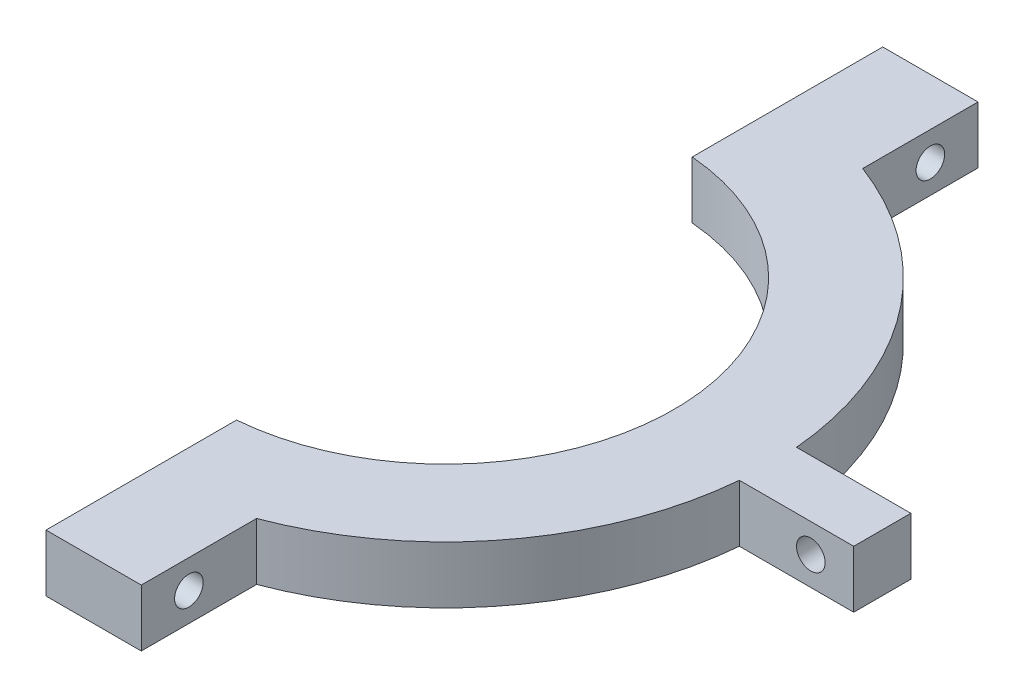
ISO-10303-21;
HEADER;
FILE_DESCRIPTION(('STEP AP214'),'2;1');
FILE_NAME('part.step','',(''),(''),'','','');
FILE_SCHEMA(('AUTOMOTIVE_DESIGN { 1 0 10303 214 1 1 1 1 }'));
ENDSEC;
DATA;
#1=APPLICATION_CONTEXT('core data for automotive mechanical design processes');
#2=APPLICATION_PROTOCOL_DEFINITION('international standard','automotive_design',2000,#1);
#3=PRODUCT_CONTEXT('',#1,'mechanical');
#4=PRODUCT('Part','Part','',(#3));
#5=PRODUCT_RELATED_PRODUCT_CATEGORY('part','',(#4));
#6=PRODUCT_DEFINITION_FORMATION('','',#4);
#7=PRODUCT_DEFINITION_CONTEXT('part definition',#1,'design');
#8=PRODUCT_DEFINITION('design','',#6,#7);
#9=PRODUCT_DEFINITION_SHAPE('','',#8);
#10=(LENGTH_UNIT() NAMED_UNIT(*) SI_UNIT(.MILLI.,.METRE.));
#11=(NAMED_UNIT(*) PLANE_ANGLE_UNIT() SI_UNIT($,.RADIAN.));
#12=(NAMED_UNIT(*) SI_UNIT($,.STERADIAN.) SOLID_ANGLE_UNIT());
#13=UNCERTAINTY_MEASURE_WITH_UNIT(LENGTH_MEASURE(1.E-05),#10,'distance_accuracy_value','');
#14=(GEOMETRIC_REPRESENTATION_CONTEXT(3) GLOBAL_UNCERTAINTY_ASSIGNED_CONTEXT((#13)) GLOBAL_UNIT_ASSIGNED_CONTEXT((#10,
#11,#12)) REPRESENTATION_CONTEXT('',''));
#15=CARTESIAN_POINT('',(0.,0.,0.));
#16=DIRECTION('',(0.,0.,1.));
#17=DIRECTION('',(1.,0.,0.));
#18=AXIS2_PLACEMENT_3D('',#15,#16,#17);
#19=CARTESIAN_POINT('',(12.,6.,43.9165214862028));
#20=DIRECTION('',(-1.,0.,0.));
#21=DIRECTION('',(0.,0.,1.));
#22=AXIS2_PLACEMENT_3D('',#19,#20,#21);
#23=PLANE('',#22);
#24=CARTESIAN_POINT('',(12.,3.,38.9165214862028));
#25=DIRECTION('',(1.,0.,0.));
#26=DIRECTION('',(0.,0.,-1.));
#27=AXIS2_PLACEMENT_3D('',#24,#25,#26);
#28=CIRCLE('',#27,1.5);
#29=CARTESIAN_POINT('',(12.,3.,37.4165214862028));
#30=VERTEX_POINT('',#29);
#31=EDGE_CURVE('E263',#30,#30,#28,.T.);
#32=ORIENTED_EDGE('',*,*,#31,.F.);
#33=EDGE_LOOP('',(#32));
#34=FACE_BOUND('',#33,.T.);
#35=DIRECTION('',(0.,0.,-1.));
#36=VECTOR('',#35,1.);
#37=CARTESIAN_POINT('',(12.,0.,43.9165214862028));
#38=LINE('',#37,#36);
#39=CARTESIAN_POINT('',(12.,0.,43.9165214862028));
#40=VERTEX_POINT('',#39);
#41=CARTESIAN_POINT('',(12.,0.,31.8119474411737));
#42=VERTEX_POINT('',#41);
#43=EDGE_CURVE('E154',#40,#42,#38,.T.);
#44=ORIENTED_EDGE('',*,*,#43,.T.);
#45=DIRECTION('',(0.,-1.,0.));
#46=VECTOR('',#45,1.);
#47=CARTESIAN_POINT('',(12.,6.,31.8119474411737));
#48=LINE('',#47,#46);
#49=CARTESIAN_POINT('',(12.,6.,31.8119474411737));
#50=VERTEX_POINT('',#49);
#51=EDGE_CURVE('E11',#50,#42,#48,.T.);
#52=ORIENTED_EDGE('',*,*,#51,.F.);
#53=DIRECTION('',(0.,0.,-1.));
#54=VECTOR('',#53,1.);
#55=CARTESIAN_POINT('',(12.,6.,43.9165214862028));
#56=LINE('',#55,#54);
#57=CARTESIAN_POINT('',(12.,6.,43.9165214862028));
#58=VERTEX_POINT('',#57);
#59=EDGE_CURVE('E177',#58,#50,#56,.T.);
#60=ORIENTED_EDGE('',*,*,#59,.F.);
#61=DIRECTION('',(0.,-1.,0.));
#62=VECTOR('',#61,1.);
#63=CARTESIAN_POINT('',(12.,6.,43.9165214862028));
#64=LINE('',#63,#62);
#65=EDGE_CURVE('E150',#58,#40,#64,.T.);
#66=ORIENTED_EDGE('',*,*,#65,.T.);
#67=EDGE_LOOP('',(#44,#52,#60,#66));
#68=FACE_BOUND('',#67,.T.);
#69=ADVANCED_FACE('F34',(#34,#68),#23,.F.);
#70=CARTESIAN_POINT('',(0.,6.,0.));
#71=DIRECTION('',(0.,-1.,0.));
#72=DIRECTION('',(0.,0.,-1.));
#73=AXIS2_PLACEMENT_3D('',#70,#71,#72);
#74=CYLINDRICAL_SURFACE('',#73,34.);
#75=CARTESIAN_POINT('',(0.,0.,0.));
#76=DIRECTION('',(0.,1.,0.));
#77=DIRECTION('',(0.,0.,1.));
#78=AXIS2_PLACEMENT_3D('',#75,#76,#77);
#79=CIRCLE('',#78,34.);
#80=CARTESIAN_POINT('',(33.8673884437522,0.,3.));
#81=VERTEX_POINT('',#80);
#82=EDGE_CURVE('E157',#42,#81,#79,.T.);
#83=ORIENTED_EDGE('',*,*,#82,.T.);
#84=DIRECTION('',(0.,-1.,0.));
#85=VECTOR('',#84,1.);
#86=CARTESIAN_POINT('',(33.8673884437522,6.,3.));
#87=LINE('',#86,#85);
#88=CARTESIAN_POINT('',(33.8673884437522,6.,3.));
#89=VERTEX_POINT('',#88);
#90=EDGE_CURVE('E42',#89,#81,#87,.T.);
#91=ORIENTED_EDGE('',*,*,#90,.F.);
#92=CARTESIAN_POINT('',(0.,6.,0.));
#93=DIRECTION('',(0.,1.,0.));
#94=DIRECTION('',(0.,0.,1.));
#95=AXIS2_PLACEMENT_3D('',#92,#93,#94);
#96=CIRCLE('',#95,34.);
#97=EDGE_CURVE('E105',#50,#89,#96,.T.);
#98=ORIENTED_EDGE('',*,*,#97,.F.);
#99=ORIENTED_EDGE('',*,*,#51,.T.);
#100=EDGE_LOOP('',(#83,#91,#98,#99));
#101=FACE_BOUND('',#100,.T.);
#102=ADVANCED_FACE('F256',(#101),#74,.T.);
#103=CARTESIAN_POINT('',(33.8673884437522,6.,3.));
#104=DIRECTION('',(0.,0.,-1.));
#105=DIRECTION('',(-1.,0.,0.));
#106=AXIS2_PLACEMENT_3D('',#103,#104,#105);
#107=PLANE('',#106);
#108=CARTESIAN_POINT('',(41.3673884437522,3.,3.));
#109=DIRECTION('',(0.,0.,-1.));
#110=DIRECTION('',(-1.,0.,0.));
#111=AXIS2_PLACEMENT_3D('',#108,#109,#110);
#112=CIRCLE('',#111,1.5);
#113=CARTESIAN_POINT('',(39.8673884437522,3.,3.));
#114=VERTEX_POINT('',#113);
#115=EDGE_CURVE('E158',#114,#114,#112,.T.);
#116=ORIENTED_EDGE('',*,*,#115,.T.);
#117=EDGE_LOOP('',(#116));
#118=FACE_BOUND('',#117,.T.);
#119=DIRECTION('',(1.,0.,0.));
#120=VECTOR('',#119,1.);
#121=CARTESIAN_POINT('',(33.8673884437522,0.,3.));
#122=LINE('',#121,#120);
#123=CARTESIAN_POINT('',(45.8673884437522,0.,3.));
#124=VERTEX_POINT('',#123);
#125=EDGE_CURVE('E160',#81,#124,#122,.T.);
#126=ORIENTED_EDGE('',*,*,#125,.T.);
#127=DIRECTION('',(0.,-1.,0.));
#128=VECTOR('',#127,1.);
#129=CARTESIAN_POINT('',(45.8673884437522,6.,3.));
#130=LINE('',#129,#128);
#131=CARTESIAN_POINT('',(45.8673884437522,6.,3.));
#132=VERTEX_POINT('',#131);
#133=EDGE_CURVE('E196',#132,#124,#130,.T.);
#134=ORIENTED_EDGE('',*,*,#133,.F.);
#135=DIRECTION('',(1.,0.,0.));
#136=VECTOR('',#135,1.);
#137=CARTESIAN_POINT('',(33.8673884437522,6.,3.));
#138=LINE('',#137,#136);
#139=EDGE_CURVE('E204',#89,#132,#138,.T.);
#140=ORIENTED_EDGE('',*,*,#139,.F.);
#141=ORIENTED_EDGE('',*,*,#90,.T.);
#142=EDGE_LOOP('',(#126,#134,#140,#141));
#143=FACE_BOUND('',#142,.T.);
#144=ADVANCED_FACE('F202',(#118,#143),#107,.F.);
#145=CARTESIAN_POINT('',(45.8673884437522,6.,3.));
#146=DIRECTION('',(-1.,0.,0.));
#147=DIRECTION('',(0.,0.,1.));
#148=AXIS2_PLACEMENT_3D('',#145,#146,#147);
#149=PLANE('',#148);
#150=DIRECTION('',(0.,0.,-1.));
#151=VECTOR('',#150,1.);
#152=CARTESIAN_POINT('',(45.8673884437522,0.,3.));
#153=LINE('',#152,#151);
#154=CARTESIAN_POINT('',(45.8673884437522,0.,-3.));
#155=VERTEX_POINT('',#154);
#156=EDGE_CURVE('E162',#124,#155,#153,.T.);
#157=ORIENTED_EDGE('',*,*,#156,.T.);
#158=DIRECTION('',(0.,-1.,0.));
#159=VECTOR('',#158,1.);
#160=CARTESIAN_POINT('',(45.8673884437522,6.,-3.));
#161=LINE('',#160,#159);
#162=CARTESIAN_POINT('',(45.8673884437522,6.,-3.));
#163=VERTEX_POINT('',#162);
#164=EDGE_CURVE('E193',#163,#155,#161,.T.);
#165=ORIENTED_EDGE('',*,*,#164,.F.);
#166=DIRECTION('',(0.,0.,-1.));
#167=VECTOR('',#166,1.);
#168=CARTESIAN_POINT('',(45.8673884437522,6.,3.));
#169=LINE('',#168,#167);
#170=EDGE_CURVE('E222',#132,#163,#169,.T.);
#171=ORIENTED_EDGE('',*,*,#170,.F.);
#172=ORIENTED_EDGE('',*,*,#133,.T.);
#173=EDGE_LOOP('',(#157,#165,#171,#172));
#174=FACE_BOUND('',#173,.T.);
#175=ADVANCED_FACE('F213',(#174),#149,.F.);
#176=CARTESIAN_POINT('',(33.8673884437522,6.,-3.));
#177=DIRECTION('',(0.,0.,1.));
#178=DIRECTION('',(1.,0.,0.));
#179=AXIS2_PLACEMENT_3D('',#176,#177,#178);
#180=PLANE('',#179);
#181=CARTESIAN_POINT('',(41.3673884437522,3.,-3.));
#182=DIRECTION('',(0.,0.,-1.));
#183=DIRECTION('',(-1.,0.,0.));
#184=AXIS2_PLACEMENT_3D('',#181,#182,#183);
#185=CIRCLE('',#184,1.5);
#186=CARTESIAN_POINT('',(39.8673884437522,3.,-3.));
#187=VERTEX_POINT('',#186);
#188=EDGE_CURVE('E269',#187,#187,#185,.T.);
#189=ORIENTED_EDGE('',*,*,#188,.F.);
#190=EDGE_LOOP('',(#189));
#191=FACE_BOUND('',#190,.T.);
#192=DIRECTION('',(-1.,0.,0.));
#193=VECTOR('',#192,1.);
#194=CARTESIAN_POINT('',(33.8673884437522,0.,-3.));
#195=LINE('',#194,#193);
#196=CARTESIAN_POINT('',(33.8673884437522,0.,-3.));
#197=VERTEX_POINT('',#196);
#198=EDGE_CURVE('E164',#155,#197,#195,.T.);
#199=ORIENTED_EDGE('',*,*,#198,.T.);
#200=DIRECTION('',(0.,-1.,0.));
#201=VECTOR('',#200,1.);
#202=CARTESIAN_POINT('',(33.8673884437522,6.,-3.));
#203=LINE('',#202,#201);
#204=CARTESIAN_POINT('',(33.8673884437522,6.,-3.));
#205=VERTEX_POINT('',#204);
#206=EDGE_CURVE('E190',#205,#197,#203,.T.);
#207=ORIENTED_EDGE('',*,*,#206,.F.);
#208=DIRECTION('',(-1.,0.,0.));
#209=VECTOR('',#208,1.);
#210=CARTESIAN_POINT('',(33.8673884437522,6.,-3.));
#211=LINE('',#210,#209);
#212=EDGE_CURVE('E219',#163,#205,#211,.T.);
#213=ORIENTED_EDGE('',*,*,#212,.F.);
#214=ORIENTED_EDGE('',*,*,#164,.T.);
#215=EDGE_LOOP('',(#199,#207,#213,#214));
#216=FACE_BOUND('',#215,.T.);
#217=ADVANCED_FACE('F217',(#191,#216),#180,.F.);
#218=CARTESIAN_POINT('',(0.,6.,0.));
#219=DIRECTION('',(0.,-1.,0.));
#220=DIRECTION('',(0.,0.,-1.));
#221=AXIS2_PLACEMENT_3D('',#218,#219,#220);
#222=CYLINDRICAL_SURFACE('',#221,34.);
#223=CARTESIAN_POINT('',(0.,0.,0.));
#224=DIRECTION('',(0.,1.,0.));
#225=DIRECTION('',(0.,0.,1.));
#226=AXIS2_PLACEMENT_3D('',#223,#224,#225);
#227=CIRCLE('',#226,34.);
#228=CARTESIAN_POINT('',(12.,0.,-31.8119474411737));
#229=VERTEX_POINT('',#228);
#230=EDGE_CURVE('E166',#197,#229,#227,.T.);
#231=ORIENTED_EDGE('',*,*,#230,.T.);
#232=DIRECTION('',(0.,-1.,0.));
#233=VECTOR('',#232,1.);
#234=CARTESIAN_POINT('',(12.,6.,-31.8119474411737));
#235=LINE('',#234,#233);
#236=CARTESIAN_POINT('',(12.,6.,-31.8119474411737));
#237=VERTEX_POINT('',#236);
#238=EDGE_CURVE('E187',#237,#229,#235,.T.);
#239=ORIENTED_EDGE('',*,*,#238,.F.);
#240=CARTESIAN_POINT('',(0.,6.,0.));
#241=DIRECTION('',(0.,1.,0.));
#242=DIRECTION('',(0.,0.,1.));
#243=AXIS2_PLACEMENT_3D('',#240,#241,#242);
#244=CIRCLE('',#243,34.);
#245=EDGE_CURVE('E221',#205,#237,#244,.T.);
#246=ORIENTED_EDGE('',*,*,#245,.F.);
#247=ORIENTED_EDGE('',*,*,#206,.T.);
#248=EDGE_LOOP('',(#231,#239,#246,#247));
#249=FACE_BOUND('',#248,.T.);
#250=ADVANCED_FACE('F309',(#249),#222,.T.);
#251=CARTESIAN_POINT('',(12.,6.,-43.9165214862028));
#252=DIRECTION('',(-1.,0.,0.));
#253=DIRECTION('',(0.,0.,1.));
#254=AXIS2_PLACEMENT_3D('',#251,#252,#253);
#255=PLANE('',#254);
#256=CARTESIAN_POINT('',(12.,3.,-38.9165214862028));
#257=DIRECTION('',(-1.,0.,0.));
#258=DIRECTION('',(0.,0.,1.));
#259=AXIS2_PLACEMENT_3D('',#256,#257,#258);
#260=CIRCLE('',#259,1.5);
#261=CARTESIAN_POINT('',(12.,3.,-37.4165214862028));
#262=VERTEX_POINT('',#261);
#263=EDGE_CURVE('E272',#262,#262,#260,.T.);
#264=ORIENTED_EDGE('',*,*,#263,.T.);
#265=EDGE_LOOP('',(#264));
#266=FACE_BOUND('',#265,.T.);
#267=DIRECTION('',(0.,0.,-1.));
#268=VECTOR('',#267,1.);
#269=CARTESIAN_POINT('',(12.,0.,-43.9165214862028));
#270=LINE('',#269,#268);
#271=CARTESIAN_POINT('',(12.,0.,-43.9165214862028));
#272=VERTEX_POINT('',#271);
#273=EDGE_CURVE('E168',#229,#272,#270,.T.);
#274=ORIENTED_EDGE('',*,*,#273,.T.);
#275=DIRECTION('',(0.,-1.,0.));
#276=VECTOR('',#275,1.);
#277=CARTESIAN_POINT('',(12.,6.,-43.9165214862028));
#278=LINE('',#277,#276);
#279=CARTESIAN_POINT('',(12.,6.,-43.9165214862028));
#280=VERTEX_POINT('',#279);
#281=EDGE_CURVE('E184',#280,#272,#278,.T.);
#282=ORIENTED_EDGE('',*,*,#281,.F.);
#283=DIRECTION('',(0.,0.,-1.));
#284=VECTOR('',#283,1.);
#285=CARTESIAN_POINT('',(12.,6.,-43.9165214862028));
#286=LINE('',#285,#284);
#287=EDGE_CURVE('E224',#237,#280,#286,.T.);
#288=ORIENTED_EDGE('',*,*,#287,.F.);
#289=ORIENTED_EDGE('',*,*,#238,.T.);
#290=EDGE_LOOP('',(#274,#282,#288,#289));
#291=FACE_BOUND('',#290,.T.);
#292=ADVANCED_FACE('F306',(#266,#291),#255,.F.);
#293=CARTESIAN_POINT('',(1.99999999999999,6.,-43.9165214862028));
#294=DIRECTION('',(0.,0.,1.));
#295=DIRECTION('',(1.,0.,0.));
#296=AXIS2_PLACEMENT_3D('',#293,#294,#295);
#297=PLANE('',#296);
#298=DIRECTION('',(-1.,0.,0.));
#299=VECTOR('',#298,1.);
#300=CARTESIAN_POINT('',(1.99999999999999,0.,-43.9165214862028));
#301=LINE('',#300,#299);
#302=CARTESIAN_POINT('',(1.99999999999999,0.,-43.9165214862028));
#303=VERTEX_POINT('',#302);
#304=EDGE_CURVE('E170',#272,#303,#301,.T.);
#305=ORIENTED_EDGE('',*,*,#304,.T.);
#306=DIRECTION('',(0.,-1.,0.));
#307=VECTOR('',#306,1.);
#308=CARTESIAN_POINT('',(1.99999999999999,6.,-43.9165214862028));
#309=LINE('',#308,#307);
#310=CARTESIAN_POINT('',(1.99999999999999,6.,-43.9165214862028));
#311=VERTEX_POINT('',#310);
#312=EDGE_CURVE('E181',#311,#303,#309,.T.);
#313=ORIENTED_EDGE('',*,*,#312,.F.);
#314=DIRECTION('',(-1.,0.,0.));
#315=VECTOR('',#314,1.);
#316=CARTESIAN_POINT('',(1.99999999999999,6.,-43.9165214862028));
#317=LINE('',#316,#315);
#318=EDGE_CURVE('E230',#280,#311,#317,.T.);
#319=ORIENTED_EDGE('',*,*,#318,.F.);
#320=ORIENTED_EDGE('',*,*,#281,.T.);
#321=EDGE_LOOP('',(#305,#313,#319,#320));
#322=FACE_BOUND('',#321,.T.);
#323=ADVANCED_FACE('F236',(#322),#297,.F.);
#324=CARTESIAN_POINT('',(1.99999999999999,6.,-43.9165214862028));
#325=DIRECTION('',(1.,0.,0.));
#326=DIRECTION('',(0.,0.,-1.));
#327=AXIS2_PLACEMENT_3D('',#324,#325,#326);
#328=PLANE('',#327);
#329=CARTESIAN_POINT('',(1.99999999999995,3.,-38.9165214862028));
#330=DIRECTION('',(-1.,0.,0.));
#331=DIRECTION('',(0.,0.,1.));
#332=AXIS2_PLACEMENT_3D('',#329,#330,#331);
#333=CIRCLE('',#332,1.5);
#334=CARTESIAN_POINT('',(1.99999999999995,3.,-37.4165214862028));
#335=VERTEX_POINT('',#334);
#336=EDGE_CURVE('E266',#335,#335,#333,.T.);
#337=ORIENTED_EDGE('',*,*,#336,.F.);
#338=EDGE_LOOP('',(#337));
#339=FACE_BOUND('',#338,.T.);
#340=DIRECTION('',(0.,0.,1.));
#341=VECTOR('',#340,1.);
#342=CARTESIAN_POINT('',(1.99999999999999,0.,-43.9165214862028));
#343=LINE('',#342,#341);
#344=CARTESIAN_POINT('',(1.99999999999999,0.,-23.9165214862028));
#345=VERTEX_POINT('',#344);
#346=EDGE_CURVE('E172',#303,#345,#343,.T.);
#347=ORIENTED_EDGE('',*,*,#346,.T.);
#348=DIRECTION('',(0.,-1.,0.));
#349=VECTOR('',#348,1.);
#350=CARTESIAN_POINT('',(1.99999999999999,6.,-23.9165214862028));
#351=LINE('',#350,#349);
#352=CARTESIAN_POINT('',(1.99999999999999,6.,-23.9165214862028));
#353=VERTEX_POINT('',#352);
#354=EDGE_CURVE('E145',#353,#345,#351,.T.);
#355=ORIENTED_EDGE('',*,*,#354,.F.);
#356=DIRECTION('',(0.,0.,1.));
#357=VECTOR('',#356,1.);
#358=CARTESIAN_POINT('',(1.99999999999999,6.,-43.9165214862028));
#359=LINE('',#358,#357);
#360=EDGE_CURVE('E136',#311,#353,#359,.T.);
#361=ORIENTED_EDGE('',*,*,#360,.F.);
#362=ORIENTED_EDGE('',*,*,#312,.T.);
#363=EDGE_LOOP('',(#347,#355,#361,#362));
#364=FACE_BOUND('',#363,.T.);
#365=ADVANCED_FACE('F240',(#339,#364),#328,.F.);
#366=CARTESIAN_POINT('',(0.,6.,0.));
#367=DIRECTION('',(0.,-1.,0.));
#368=DIRECTION('',(0.,0.,-1.));
#369=AXIS2_PLACEMENT_3D('',#366,#367,#368);
#370=CYLINDRICAL_SURFACE('',#369,24.);
#371=CARTESIAN_POINT('',(0.,0.,0.));
#372=DIRECTION('',(0.,-1.,0.));
#373=DIRECTION('',(0.,0.,1.));
#374=AXIS2_PLACEMENT_3D('',#371,#372,#373);
#375=CIRCLE('',#374,24.);
#376=CARTESIAN_POINT('',(2.,0.,23.9165214862028));
#377=VERTEX_POINT('',#376);
#378=EDGE_CURVE('E144',#345,#377,#375,.T.);
#379=ORIENTED_EDGE('',*,*,#378,.T.);
#380=DIRECTION('',(0.,-1.,0.));
#381=VECTOR('',#380,1.);
#382=CARTESIAN_POINT('',(2.,6.,23.9165214862028));
#383=LINE('',#382,#381);
#384=CARTESIAN_POINT('',(2.,6.,23.9165214862028));
#385=VERTEX_POINT('',#384);
#386=EDGE_CURVE('E141',#385,#377,#383,.T.);
#387=ORIENTED_EDGE('',*,*,#386,.F.);
#388=CARTESIAN_POINT('',(0.,6.,0.));
#389=DIRECTION('',(0.,-1.,0.));
#390=DIRECTION('',(0.,0.,1.));
#391=AXIS2_PLACEMENT_3D('',#388,#389,#390);
#392=CIRCLE('',#391,24.);
#393=EDGE_CURVE('E130',#353,#385,#392,.T.);
#394=ORIENTED_EDGE('',*,*,#393,.F.);
#395=ORIENTED_EDGE('',*,*,#354,.T.);
#396=EDGE_LOOP('',(#379,#387,#394,#395));
#397=FACE_BOUND('',#396,.T.);
#398=ADVANCED_FACE('F142',(#397),#370,.F.);
#399=CARTESIAN_POINT('',(2.,6.,23.9165214862028));
#400=DIRECTION('',(1.,0.,0.));
#401=DIRECTION('',(0.,0.,-1.));
#402=AXIS2_PLACEMENT_3D('',#399,#400,#401);
#403=PLANE('',#402);
#404=CARTESIAN_POINT('',(1.99999999999997,3.,38.9165214862028));
#405=DIRECTION('',(1.,0.,0.));
#406=DIRECTION('',(0.,0.,-1.));
#407=AXIS2_PLACEMENT_3D('',#404,#405,#406);
#408=CIRCLE('',#407,1.5);
#409=CARTESIAN_POINT('',(1.99999999999997,3.,37.4165214862028));
#410=VERTEX_POINT('',#409);
#411=EDGE_CURVE('E265',#410,#410,#408,.T.);
#412=ORIENTED_EDGE('',*,*,#411,.T.);
#413=EDGE_LOOP('',(#412));
#414=FACE_BOUND('',#413,.T.);
#415=DIRECTION('',(0.,0.,1.));
#416=VECTOR('',#415,1.);
#417=CARTESIAN_POINT('',(2.,0.,23.9165214862028));
#418=LINE('',#417,#416);
#419=CARTESIAN_POINT('',(2.00000000000001,0.,43.9165214862028));
#420=VERTEX_POINT('',#419);
#421=EDGE_CURVE('E91',#377,#420,#418,.T.);
#422=ORIENTED_EDGE('',*,*,#421,.T.);
#423=DIRECTION('',(0.,-1.,0.));
#424=VECTOR('',#423,1.);
#425=CARTESIAN_POINT('',(2.00000000000001,6.,43.9165214862028));
#426=LINE('',#425,#424);
#427=CARTESIAN_POINT('',(2.00000000000001,6.,43.9165214862028));
#428=VERTEX_POINT('',#427);
#429=EDGE_CURVE('E146',#428,#420,#426,.T.);
#430=ORIENTED_EDGE('',*,*,#429,.F.);
#431=DIRECTION('',(0.,0.,1.));
#432=VECTOR('',#431,1.);
#433=CARTESIAN_POINT('',(2.,6.,23.9165214862028));
#434=LINE('',#433,#432);
#435=EDGE_CURVE('E134',#385,#428,#434,.T.);
#436=ORIENTED_EDGE('',*,*,#435,.F.);
#437=ORIENTED_EDGE('',*,*,#386,.T.);
#438=EDGE_LOOP('',(#422,#430,#436,#437));
#439=FACE_BOUND('',#438,.T.);
#440=ADVANCED_FACE('F148',(#414,#439),#403,.F.);
#441=CARTESIAN_POINT('',(2.00000000000001,6.,43.9165214862028));
#442=DIRECTION('',(0.,0.,-1.));
#443=DIRECTION('',(-1.,0.,0.));
#444=AXIS2_PLACEMENT_3D('',#441,#442,#443);
#445=PLANE('',#444);
#446=DIRECTION('',(1.,0.,0.));
#447=VECTOR('',#446,1.);
#448=CARTESIAN_POINT('',(2.00000000000001,0.,43.9165214862028));
#449=LINE('',#448,#447);
#450=EDGE_CURVE('E97',#420,#40,#449,.T.);
#451=ORIENTED_EDGE('',*,*,#450,.T.);
#452=ORIENTED_EDGE('',*,*,#65,.F.);
#453=DIRECTION('',(1.,0.,0.));
#454=VECTOR('',#453,1.);
#455=CARTESIAN_POINT('',(2.00000000000001,6.,43.9165214862028));
#456=LINE('',#455,#454);
#457=EDGE_CURVE('E50',#428,#58,#456,.T.);
#458=ORIENTED_EDGE('',*,*,#457,.F.);
#459=ORIENTED_EDGE('',*,*,#429,.T.);
#460=EDGE_LOOP('',(#451,#452,#458,#459));
#461=FACE_BOUND('',#460,.T.);
#462=ADVANCED_FACE('F244',(#461),#445,.F.);
#463=CARTESIAN_POINT('',(0.,6.,0.));
#464=DIRECTION('',(0.,1.,0.));
#465=DIRECTION('',(0.,0.,1.));
#466=AXIS2_PLACEMENT_3D('',#463,#464,#465);
#467=PLANE('',#466);
#468=ORIENTED_EDGE('',*,*,#59,.T.);
#469=ORIENTED_EDGE('',*,*,#97,.T.);
#470=ORIENTED_EDGE('',*,*,#139,.T.);
#471=ORIENTED_EDGE('',*,*,#170,.T.);
#472=ORIENTED_EDGE('',*,*,#212,.T.);
#473=ORIENTED_EDGE('',*,*,#245,.T.);
#474=ORIENTED_EDGE('',*,*,#287,.T.);
#475=ORIENTED_EDGE('',*,*,#318,.T.);
#476=ORIENTED_EDGE('',*,*,#360,.T.);
#477=ORIENTED_EDGE('',*,*,#393,.T.);
#478=ORIENTED_EDGE('',*,*,#435,.T.);
#479=ORIENTED_EDGE('',*,*,#457,.T.);
#480=EDGE_LOOP('',(#468,#469,#470,#471,#472,#473,#474,#475,#476,#477,#478,#479));
#481=FACE_BOUND('',#480,.T.);
#482=ADVANCED_FACE('F132',(#481),#467,.T.);
#483=CARTESIAN_POINT('',(0.,0.,0.));
#484=DIRECTION('',(0.,1.,0.));
#485=DIRECTION('',(0.,0.,1.));
#486=AXIS2_PLACEMENT_3D('',#483,#484,#485);
#487=PLANE('',#486);
#488=ORIENTED_EDGE('',*,*,#43,.F.);
#489=ORIENTED_EDGE('',*,*,#450,.F.);
#490=ORIENTED_EDGE('',*,*,#421,.F.);
#491=ORIENTED_EDGE('',*,*,#378,.F.);
#492=ORIENTED_EDGE('',*,*,#346,.F.);
#493=ORIENTED_EDGE('',*,*,#304,.F.);
#494=ORIENTED_EDGE('',*,*,#273,.F.);
#495=ORIENTED_EDGE('',*,*,#230,.F.);
#496=ORIENTED_EDGE('',*,*,#198,.F.);
#497=ORIENTED_EDGE('',*,*,#156,.F.);
#498=ORIENTED_EDGE('',*,*,#125,.F.);
#499=ORIENTED_EDGE('',*,*,#82,.F.);
#500=EDGE_LOOP('',(#488,#489,#490,#491,#492,#493,#494,#495,#496,#497,#498,#499));
#501=FACE_BOUND('',#500,.T.);
#502=ADVANCED_FACE('F208',(#501),#487,.F.);
#503=CARTESIAN_POINT('',(41.3673884437522,3.,43.9165214862028));
#504=DIRECTION('',(0.,0.,-1.));
#505=DIRECTION('',(-1.,0.,0.));
#506=AXIS2_PLACEMENT_3D('',#503,#504,#505);
#507=CYLINDRICAL_SURFACE('',#506,1.5);
#508=ORIENTED_EDGE('',*,*,#188,.T.);
#509=EDGE_LOOP('',(#508));
#510=FACE_BOUND('',#509,.T.);
#511=ORIENTED_EDGE('',*,*,#115,.F.);
#512=EDGE_LOOP('',(#511));
#513=FACE_BOUND('',#512,.T.);
#514=ADVANCED_FACE('F284',(#510,#513),#507,.F.);
#515=CARTESIAN_POINT('',(1.99999999999997,3.,38.9165214862028));
#516=DIRECTION('',(1.,0.,0.));
#517=DIRECTION('',(0.,0.,-1.));
#518=AXIS2_PLACEMENT_3D('',#515,#516,#517);
#519=CYLINDRICAL_SURFACE('',#518,1.5);
#520=ORIENTED_EDGE('',*,*,#411,.F.);
#521=EDGE_LOOP('',(#520));
#522=FACE_BOUND('',#521,.T.);
#523=ORIENTED_EDGE('',*,*,#31,.T.);
#524=EDGE_LOOP('',(#523));
#525=FACE_BOUND('',#524,.T.);
#526=ADVANCED_FACE('F286',(#522,#525),#519,.F.);
#527=CARTESIAN_POINT('',(1.99999999999995,3.,-38.9165214862028));
#528=DIRECTION('',(1.,0.,0.));
#529=DIRECTION('',(0.,0.,-1.));
#530=AXIS2_PLACEMENT_3D('',#527,#528,#529);
#531=CYLINDRICAL_SURFACE('',#530,1.5);
#532=ORIENTED_EDGE('',*,*,#336,.T.);
#533=EDGE_LOOP('',(#532));
#534=FACE_BOUND('',#533,.T.);
#535=ORIENTED_EDGE('',*,*,#263,.F.);
#536=EDGE_LOOP('',(#535));
#537=FACE_BOUND('',#536,.T.);
#538=ADVANCED_FACE('F293',(#534,#537),#531,.F.);
#539=CLOSED_SHELL('',(#69,#102,#144,#175,#217,#250,#292,#323,#365,#398,#440,#462,#482,#502,#514,
#526,#538));
#540=MANIFOLD_SOLID_BREP('B2',#539);
#541=ADVANCED_BREP_SHAPE_REPRESENTATION('',(#18,#540),#14);
#542=SHAPE_DEFINITION_REPRESENTATION(#9,#541);
ENDSEC;
END-ISO-10303-21;
